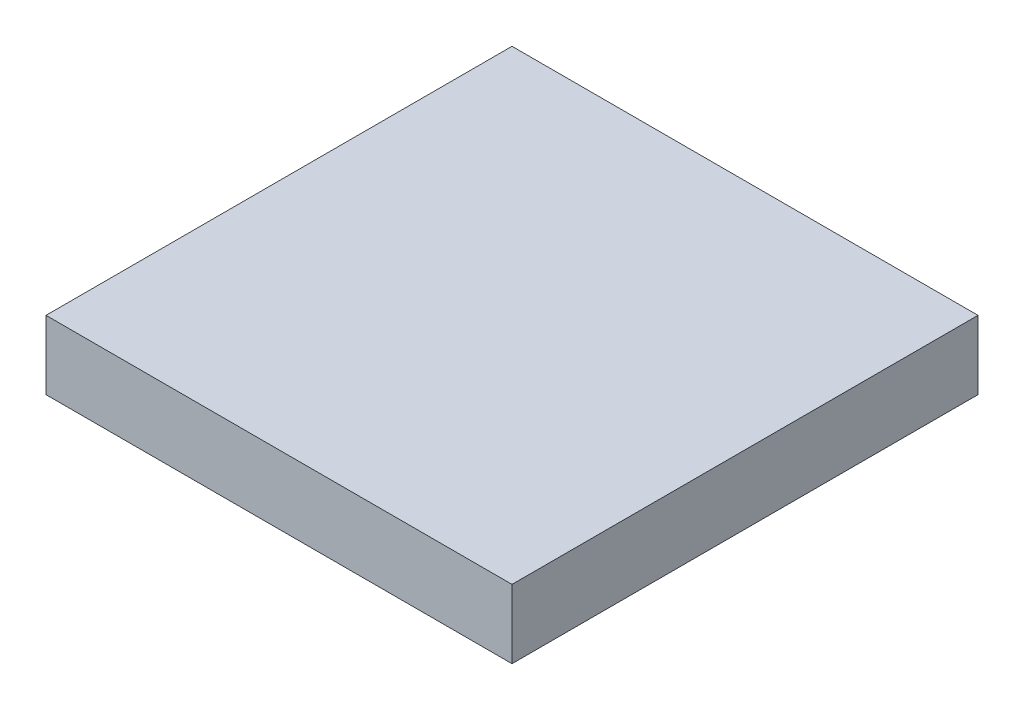
ISO-10303-21;
HEADER;
FILE_DESCRIPTION(('STEP AP214'),'2;1');
FILE_NAME('part.step','',(''),(''),'','','');
FILE_SCHEMA(('AUTOMOTIVE_DESIGN { 1 0 10303 214 1 1 1 1 }'));
ENDSEC;
DATA;
#1=APPLICATION_CONTEXT('core data for automotive mechanical design processes');
#2=APPLICATION_PROTOCOL_DEFINITION('international standard','automotive_design',2000,#1);
#3=PRODUCT_CONTEXT('',#1,'mechanical');
#4=PRODUCT('Part','Part','',(#3));
#5=PRODUCT_RELATED_PRODUCT_CATEGORY('part','',(#4));
#6=PRODUCT_DEFINITION_FORMATION('','',#4);
#7=PRODUCT_DEFINITION_CONTEXT('part definition',#1,'design');
#8=PRODUCT_DEFINITION('design','',#6,#7);
#9=PRODUCT_DEFINITION_SHAPE('','',#8);
#10=(LENGTH_UNIT() NAMED_UNIT(*) SI_UNIT(.MILLI.,.METRE.));
#11=(NAMED_UNIT(*) PLANE_ANGLE_UNIT() SI_UNIT($,.RADIAN.));
#12=(NAMED_UNIT(*) SI_UNIT($,.STERADIAN.) SOLID_ANGLE_UNIT());
#13=UNCERTAINTY_MEASURE_WITH_UNIT(LENGTH_MEASURE(1.E-05),#10,'distance_accuracy_value','');
#14=(GEOMETRIC_REPRESENTATION_CONTEXT(3) GLOBAL_UNCERTAINTY_ASSIGNED_CONTEXT((#13)) GLOBAL_UNIT_ASSIGNED_CONTEXT((#10,
#11,#12)) REPRESENTATION_CONTEXT('',''));
#15=CARTESIAN_POINT('',(0.,0.,0.));
#16=DIRECTION('',(0.,0.,1.));
#17=DIRECTION('',(1.,0.,0.));
#18=AXIS2_PLACEMENT_3D('',#15,#16,#17);
#19=CARTESIAN_POINT('',(311.055684786296,98.321576558156,7.34009304640806));
#20=DIRECTION('',(0.,0.,-1.));
#21=DIRECTION('',(-1.,0.,0.));
#22=AXIS2_PLACEMENT_3D('',#19,#20,#21);
#23=PLANE('',#22);
#24=DIRECTION('',(1.,0.,0.));
#25=VECTOR('',#24,1.);
#26=CARTESIAN_POINT('',(311.055684786296,90.5892800165043,7.34009304640806));
#27=LINE('',#26,#25);
#28=CARTESIAN_POINT('',(311.055684786296,90.5892800165043,7.34009304640806));
#29=VERTEX_POINT('',#28);
#30=CARTESIAN_POINT('',(363.498182619916,90.5892800165043,7.34009304640802));
#31=VERTEX_POINT('',#30);
#32=EDGE_CURVE('E79',#29,#31,#27,.T.);
#33=ORIENTED_EDGE('',*,*,#32,.F.);
#34=DIRECTION('',(0.,-1.,0.));
#35=VECTOR('',#34,1.);
#36=CARTESIAN_POINT('',(311.055684786296,98.321576558156,7.34009304640806));
#37=LINE('',#36,#35);
#38=CARTESIAN_POINT('',(311.055684786296,98.321576558156,7.34009304640806));
#39=VERTEX_POINT('',#38);
#40=EDGE_CURVE('E32',#39,#29,#37,.T.);
#41=ORIENTED_EDGE('',*,*,#40,.F.);
#42=DIRECTION('',(1.,0.,0.));
#43=VECTOR('',#42,1.);
#44=CARTESIAN_POINT('',(311.055684786296,98.321576558156,7.34009304640806));
#45=LINE('',#44,#43);
#46=CARTESIAN_POINT('',(363.498182619916,98.321576558156,7.34009304640802));
#47=VERTEX_POINT('',#46);
#48=EDGE_CURVE('E71',#39,#47,#45,.T.);
#49=ORIENTED_EDGE('',*,*,#48,.T.);
#50=DIRECTION('',(0.,-1.,0.));
#51=VECTOR('',#50,1.);
#52=CARTESIAN_POINT('',(363.498182619916,98.321576558156,7.34009304640802));
#53=LINE('',#52,#51);
#54=EDGE_CURVE('E10',#47,#31,#53,.T.);
#55=ORIENTED_EDGE('',*,*,#54,.T.);
#56=EDGE_LOOP('',(#33,#41,#49,#55));
#57=FACE_BOUND('',#56,.T.);
#58=ADVANCED_FACE('F16',(#57),#23,.T.);
#59=CARTESIAN_POINT('',(363.498182619916,98.321576558156,7.34009304640802));
#60=DIRECTION('',(1.,0.,0.));
#61=DIRECTION('',(0.,0.,-1.));
#62=AXIS2_PLACEMENT_3D('',#59,#60,#61);
#63=PLANE('',#62);
#64=DIRECTION('',(0.,0.,1.));
#65=VECTOR('',#64,1.);
#66=CARTESIAN_POINT('',(363.498182619916,90.5892800165043,7.34009304640802));
#67=LINE('',#66,#65);
#68=CARTESIAN_POINT('',(363.498182619916,90.5892800165043,59.7825908800286));
#69=VERTEX_POINT('',#68);
#70=EDGE_CURVE('E82',#31,#69,#67,.T.);
#71=ORIENTED_EDGE('',*,*,#70,.F.);
#72=ORIENTED_EDGE('',*,*,#54,.F.);
#73=DIRECTION('',(0.,0.,1.));
#74=VECTOR('',#73,1.);
#75=CARTESIAN_POINT('',(363.498182619916,98.321576558156,7.34009304640802));
#76=LINE('',#75,#74);
#77=CARTESIAN_POINT('',(363.498182619916,98.321576558156,59.7825908800286));
#78=VERTEX_POINT('',#77);
#79=EDGE_CURVE('E67',#47,#78,#76,.T.);
#80=ORIENTED_EDGE('',*,*,#79,.T.);
#81=DIRECTION('',(0.,-1.,0.));
#82=VECTOR('',#81,1.);
#83=CARTESIAN_POINT('',(363.498182619916,98.321576558156,59.7825908800286));
#84=LINE('',#83,#82);
#85=EDGE_CURVE('E24',#78,#69,#84,.T.);
#86=ORIENTED_EDGE('',*,*,#85,.T.);
#87=EDGE_LOOP('',(#71,#72,#80,#86));
#88=FACE_BOUND('',#87,.T.);
#89=ADVANCED_FACE('F68',(#88),#63,.T.);
#90=CARTESIAN_POINT('',(363.498182619916,98.321576558156,59.7825908800286));
#91=DIRECTION('',(0.,0.,1.));
#92=DIRECTION('',(1.,0.,0.));
#93=AXIS2_PLACEMENT_3D('',#90,#91,#92);
#94=PLANE('',#93);
#95=DIRECTION('',(-1.,0.,0.));
#96=VECTOR('',#95,1.);
#97=CARTESIAN_POINT('',(363.498182619916,90.5892800165043,59.7825908800286));
#98=LINE('',#97,#96);
#99=CARTESIAN_POINT('',(311.055684786296,90.5892800165043,59.7825908800286));
#100=VERTEX_POINT('',#99);
#101=EDGE_CURVE('E65',#69,#100,#98,.T.);
#102=ORIENTED_EDGE('',*,*,#101,.F.);
#103=ORIENTED_EDGE('',*,*,#85,.F.);
#104=DIRECTION('',(-1.,0.,0.));
#105=VECTOR('',#104,1.);
#106=CARTESIAN_POINT('',(363.498182619916,98.321576558156,59.7825908800286));
#107=LINE('',#106,#105);
#108=CARTESIAN_POINT('',(311.055684786296,98.321576558156,59.7825908800286));
#109=VERTEX_POINT('',#108);
#110=EDGE_CURVE('E62',#78,#109,#107,.T.);
#111=ORIENTED_EDGE('',*,*,#110,.T.);
#112=DIRECTION('',(0.,-1.,0.));
#113=VECTOR('',#112,1.);
#114=CARTESIAN_POINT('',(311.055684786296,98.321576558156,59.7825908800286));
#115=LINE('',#114,#113);
#116=EDGE_CURVE('E48',#109,#100,#115,.T.);
#117=ORIENTED_EDGE('',*,*,#116,.T.);
#118=EDGE_LOOP('',(#102,#103,#111,#117));
#119=FACE_BOUND('',#118,.T.);
#120=ADVANCED_FACE('F60',(#119),#94,.T.);
#121=CARTESIAN_POINT('',(311.055684786296,98.321576558156,59.7825908800286));
#122=DIRECTION('',(-1.,0.,0.));
#123=DIRECTION('',(0.,0.,1.));
#124=AXIS2_PLACEMENT_3D('',#121,#122,#123);
#125=PLANE('',#124);
#126=DIRECTION('',(0.,0.,-1.));
#127=VECTOR('',#126,1.);
#128=CARTESIAN_POINT('',(311.055684786296,90.5892800165043,59.7825908800286));
#129=LINE('',#128,#127);
#130=EDGE_CURVE('E85',#100,#29,#129,.T.);
#131=ORIENTED_EDGE('',*,*,#130,.F.);
#132=ORIENTED_EDGE('',*,*,#116,.F.);
#133=DIRECTION('',(0.,0.,-1.));
#134=VECTOR('',#133,1.);
#135=CARTESIAN_POINT('',(311.055684786296,98.321576558156,59.7825908800286));
#136=LINE('',#135,#134);
#137=EDGE_CURVE('E74',#109,#39,#136,.T.);
#138=ORIENTED_EDGE('',*,*,#137,.T.);
#139=ORIENTED_EDGE('',*,*,#40,.T.);
#140=EDGE_LOOP('',(#131,#132,#138,#139));
#141=FACE_BOUND('',#140,.T.);
#142=ADVANCED_FACE('F96',(#141),#125,.T.);
#143=CARTESIAN_POINT('',(311.776933703106,98.321576558156,33.5613419632183));
#144=DIRECTION('',(0.,-1.,0.));
#145=DIRECTION('',(1.,0.,0.));
#146=AXIS2_PLACEMENT_3D('',#143,#144,#145);
#147=PLANE('',#146);
#148=ORIENTED_EDGE('',*,*,#48,.F.);
#149=ORIENTED_EDGE('',*,*,#137,.F.);
#150=ORIENTED_EDGE('',*,*,#110,.F.);
#151=ORIENTED_EDGE('',*,*,#79,.F.);
#152=EDGE_LOOP('',(#148,#149,#150,#151));
#153=FACE_BOUND('',#152,.T.);
#154=ADVANCED_FACE('F73',(#153),#147,.F.);
#155=CARTESIAN_POINT('',(311.776933703106,90.5892800165043,33.5613419632183));
#156=DIRECTION('',(0.,-1.,0.));
#157=DIRECTION('',(1.,0.,0.));
#158=AXIS2_PLACEMENT_3D('',#155,#156,#157);
#159=PLANE('',#158);
#160=ORIENTED_EDGE('',*,*,#32,.T.);
#161=ORIENTED_EDGE('',*,*,#70,.T.);
#162=ORIENTED_EDGE('',*,*,#101,.T.);
#163=ORIENTED_EDGE('',*,*,#130,.T.);
#164=EDGE_LOOP('',(#160,#161,#162,#163));
#165=FACE_BOUND('',#164,.T.);
#166=ADVANCED_FACE('F89',(#165),#159,.T.);
#167=CLOSED_SHELL('',(#58,#89,#120,#142,#154,#166));
#168=MANIFOLD_SOLID_BREP('B1',#167);
#169=ADVANCED_BREP_SHAPE_REPRESENTATION('',(#18,#168),#14);
#170=SHAPE_DEFINITION_REPRESENTATION(#9,#169);
ENDSEC;
END-ISO-10303-21;
